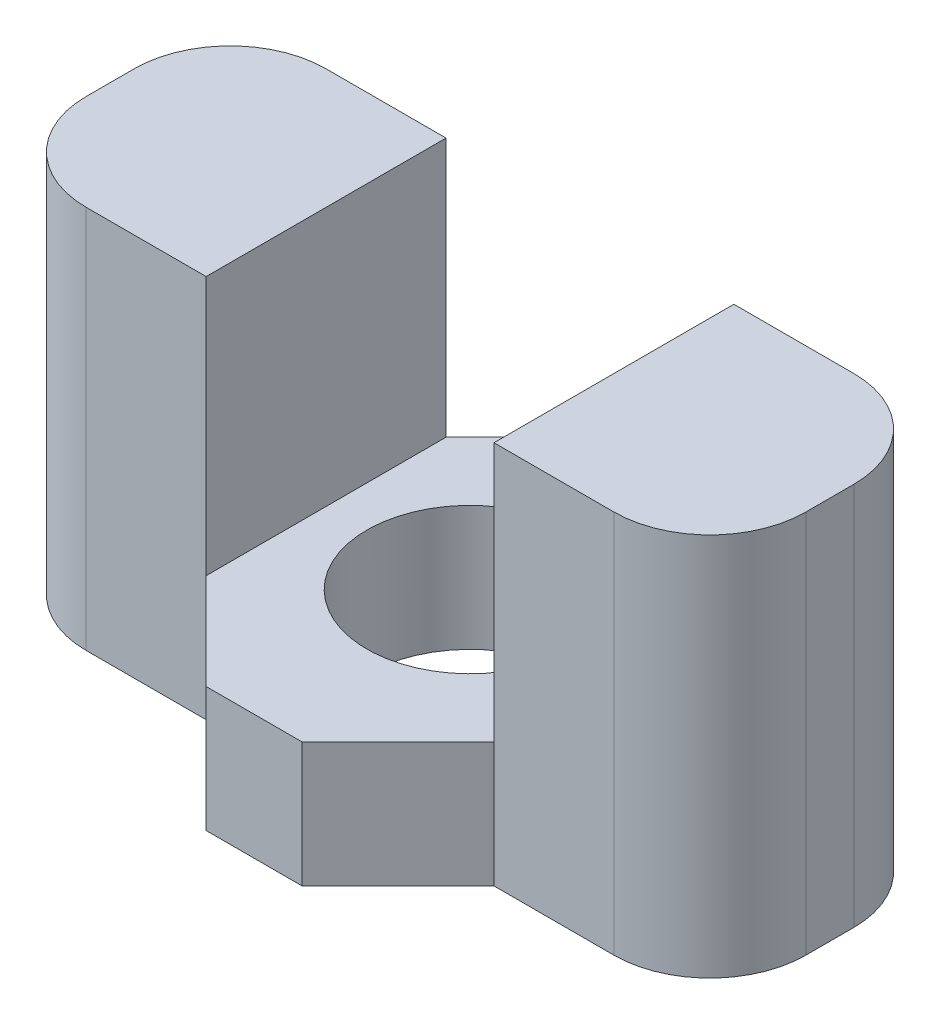
ISO-10303-21;
HEADER;
FILE_DESCRIPTION(('STEP AP214'),'2;1');
FILE_NAME('part.step','',(''),(''),'','','');
FILE_SCHEMA(('AUTOMOTIVE_DESIGN { 1 0 10303 214 1 1 1 1 }'));
ENDSEC;
DATA;
#1=APPLICATION_CONTEXT('core data for automotive mechanical design processes');
#2=APPLICATION_PROTOCOL_DEFINITION('international standard','automotive_design',2000,#1);
#3=PRODUCT_CONTEXT('',#1,'mechanical');
#4=PRODUCT('Part','Part','',(#3));
#5=PRODUCT_RELATED_PRODUCT_CATEGORY('part','',(#4));
#6=PRODUCT_DEFINITION_FORMATION('','',#4);
#7=PRODUCT_DEFINITION_CONTEXT('part definition',#1,'design');
#8=PRODUCT_DEFINITION('design','',#6,#7);
#9=PRODUCT_DEFINITION_SHAPE('','',#8);
#10=(LENGTH_UNIT() NAMED_UNIT(*) SI_UNIT(.MILLI.,.METRE.));
#11=(NAMED_UNIT(*) PLANE_ANGLE_UNIT() SI_UNIT($,.RADIAN.));
#12=(NAMED_UNIT(*) SI_UNIT($,.STERADIAN.) SOLID_ANGLE_UNIT());
#13=UNCERTAINTY_MEASURE_WITH_UNIT(LENGTH_MEASURE(1.E-05),#10,'distance_accuracy_value','');
#14=(GEOMETRIC_REPRESENTATION_CONTEXT(3) GLOBAL_UNCERTAINTY_ASSIGNED_CONTEXT((#13)) GLOBAL_UNIT_ASSIGNED_CONTEXT((#10,
#11,#12)) REPRESENTATION_CONTEXT('',''));
#15=CARTESIAN_POINT('',(0.,0.,0.));
#16=DIRECTION('',(0.,0.,1.));
#17=DIRECTION('',(1.,0.,0.));
#18=AXIS2_PLACEMENT_3D('',#15,#16,#17);
#19=CARTESIAN_POINT('',(0.,8.,2.5));
#20=DIRECTION('',(0.,0.,-1.));
#21=DIRECTION('',(-1.,0.,0.));
#22=AXIS2_PLACEMENT_3D('',#19,#20,#21);
#23=PLANE('',#22);
#24=DIRECTION('',(1.,0.,0.));
#25=VECTOR('',#24,1.);
#26=CARTESIAN_POINT('',(0.,8.,2.5));
#27=LINE('',#26,#25);
#28=CARTESIAN_POINT('',(-5.5,8.,2.5));
#29=VERTEX_POINT('',#28);
#30=CARTESIAN_POINT('',(-3.00000000000002,8.,2.5));
#31=VERTEX_POINT('',#30);
#32=EDGE_CURVE('E278',#29,#31,#27,.T.);
#33=ORIENTED_EDGE('',*,*,#32,.F.);
#34=DIRECTION('',(0.,-1.,0.));
#35=VECTOR('',#34,1.);
#36=CARTESIAN_POINT('',(-5.5,8.,2.5));
#37=LINE('',#36,#35);
#38=CARTESIAN_POINT('',(-5.5,0.,2.5));
#39=VERTEX_POINT('',#38);
#40=EDGE_CURVE('E11',#29,#39,#37,.T.);
#41=ORIENTED_EDGE('',*,*,#40,.T.);
#42=DIRECTION('',(1.,0.,0.));
#43=VECTOR('',#42,1.);
#44=CARTESIAN_POINT('',(0.,0.,2.5));
#45=LINE('',#44,#43);
#46=CARTESIAN_POINT('',(-3.,0.,2.5));
#47=VERTEX_POINT('',#46);
#48=EDGE_CURVE('E166',#39,#47,#45,.T.);
#49=ORIENTED_EDGE('',*,*,#48,.T.);
#50=DIRECTION('',(0.,-1.,0.));
#51=VECTOR('',#50,1.);
#52=CARTESIAN_POINT('',(-3.,8.92455532033676,2.5));
#53=LINE('',#52,#51);
#54=CARTESIAN_POINT('',(-3.,2.6,2.5));
#55=VERTEX_POINT('',#54);
#56=EDGE_CURVE('E170',#55,#47,#53,.T.);
#57=ORIENTED_EDGE('',*,*,#56,.F.);
#58=DIRECTION('',(0.,1.,0.));
#59=VECTOR('',#58,1.);
#60=CARTESIAN_POINT('',(-2.99999999999999,0.,2.5));
#61=LINE('',#60,#59);
#62=EDGE_CURVE('E215',#55,#31,#61,.T.);
#63=ORIENTED_EDGE('',*,*,#62,.T.);
#64=EDGE_LOOP('',(#33,#41,#49,#57,#63));
#65=FACE_BOUND('',#64,.T.);
#66=ADVANCED_FACE('F40',(#65),#23,.F.);
#67=CARTESIAN_POINT('',(0.,8.,-2.5));
#68=DIRECTION('',(0.,0.,-1.));
#69=DIRECTION('',(-1.,0.,0.));
#70=AXIS2_PLACEMENT_3D('',#67,#68,#69);
#71=PLANE('',#70);
#72=DIRECTION('',(1.,0.,0.));
#73=VECTOR('',#72,1.);
#74=CARTESIAN_POINT('',(0.,0.,-2.5));
#75=LINE('',#74,#73);
#76=CARTESIAN_POINT('',(-5.5,0.,-2.5));
#77=VERTEX_POINT('',#76);
#78=CARTESIAN_POINT('',(-3.,0.,-2.5));
#79=VERTEX_POINT('',#78);
#80=EDGE_CURVE('E287',#77,#79,#75,.T.);
#81=ORIENTED_EDGE('',*,*,#80,.F.);
#82=DIRECTION('',(0.,-1.,0.));
#83=VECTOR('',#82,1.);
#84=CARTESIAN_POINT('',(-5.5,8.,-2.5));
#85=LINE('',#84,#83);
#86=CARTESIAN_POINT('',(-5.5,8.,-2.5));
#87=VERTEX_POINT('',#86);
#88=EDGE_CURVE('E304',#77,#87,#85,.F.);
#89=ORIENTED_EDGE('',*,*,#88,.T.);
#90=DIRECTION('',(1.,0.,0.));
#91=VECTOR('',#90,1.);
#92=CARTESIAN_POINT('',(0.,8.,-2.5));
#93=LINE('',#92,#91);
#94=CARTESIAN_POINT('',(-3.00000000000002,8.,-2.5));
#95=VERTEX_POINT('',#94);
#96=EDGE_CURVE('E272',#87,#95,#93,.T.);
#97=ORIENTED_EDGE('',*,*,#96,.T.);
#98=DIRECTION('',(0.,1.,0.));
#99=VECTOR('',#98,1.);
#100=CARTESIAN_POINT('',(-2.99999999999999,0.,-2.5));
#101=LINE('',#100,#99);
#102=CARTESIAN_POINT('',(-3.,2.6,-2.5));
#103=VERTEX_POINT('',#102);
#104=EDGE_CURVE('E238',#103,#95,#101,.T.);
#105=ORIENTED_EDGE('',*,*,#104,.F.);
#106=DIRECTION('',(0.,-1.,0.));
#107=VECTOR('',#106,1.);
#108=CARTESIAN_POINT('',(-3.,8.92455532033676,-2.5));
#109=LINE('',#108,#107);
#110=EDGE_CURVE('E230',#103,#79,#109,.T.);
#111=ORIENTED_EDGE('',*,*,#110,.T.);
#112=EDGE_LOOP('',(#81,#89,#97,#105,#111));
#113=FACE_BOUND('',#112,.T.);
#114=ADVANCED_FACE('F379',(#113),#71,.T.);
#115=CARTESIAN_POINT('',(3.00000000000002,8.,-2.5));
#116=VERTEX_POINT('',#115);
#117=CARTESIAN_POINT('',(5.5,8.,-2.5));
#118=VERTEX_POINT('',#117);
#119=EDGE_CURVE('E271',#116,#118,#93,.T.);
#120=ORIENTED_EDGE('',*,*,#119,.T.);
#121=DIRECTION('',(0.,-1.,0.));
#122=VECTOR('',#121,1.);
#123=CARTESIAN_POINT('',(5.5,8.,-2.5));
#124=LINE('',#123,#122);
#125=CARTESIAN_POINT('',(5.5,0.,-2.5));
#126=VERTEX_POINT('',#125);
#127=EDGE_CURVE('E310',#118,#126,#124,.T.);
#128=ORIENTED_EDGE('',*,*,#127,.T.);
#129=CARTESIAN_POINT('',(3.,0.,-2.5));
#130=VERTEX_POINT('',#129);
#131=EDGE_CURVE('E286',#130,#126,#75,.T.);
#132=ORIENTED_EDGE('',*,*,#131,.F.);
#133=DIRECTION('',(0.,-1.,0.));
#134=VECTOR('',#133,1.);
#135=CARTESIAN_POINT('',(3.,8.92455532033676,-2.5));
#136=LINE('',#135,#134);
#137=CARTESIAN_POINT('',(3.,2.6,-2.5));
#138=VERTEX_POINT('',#137);
#139=EDGE_CURVE('E228',#138,#130,#136,.T.);
#140=ORIENTED_EDGE('',*,*,#139,.F.);
#141=DIRECTION('',(0.,1.,0.));
#142=VECTOR('',#141,1.);
#143=CARTESIAN_POINT('',(2.99999999999999,0.,-2.5));
#144=LINE('',#143,#142);
#145=EDGE_CURVE('E241',#138,#116,#144,.T.);
#146=ORIENTED_EDGE('',*,*,#145,.T.);
#147=EDGE_LOOP('',(#120,#128,#132,#140,#146));
#148=FACE_BOUND('',#147,.T.);
#149=ADVANCED_FACE('F328',(#148),#71,.T.);
#150=CARTESIAN_POINT('',(3.,0.,2.5));
#151=VERTEX_POINT('',#150);
#152=CARTESIAN_POINT('',(5.5,0.,2.5));
#153=VERTEX_POINT('',#152);
#154=EDGE_CURVE('E176',#151,#153,#45,.T.);
#155=ORIENTED_EDGE('',*,*,#154,.T.);
#156=DIRECTION('',(0.,-1.,0.));
#157=VECTOR('',#156,1.);
#158=CARTESIAN_POINT('',(5.5,8.,2.5));
#159=LINE('',#158,#157);
#160=CARTESIAN_POINT('',(5.5,8.,2.5));
#161=VERTEX_POINT('',#160);
#162=EDGE_CURVE('E48',#153,#161,#159,.F.);
#163=ORIENTED_EDGE('',*,*,#162,.T.);
#164=CARTESIAN_POINT('',(3.00000000000002,8.,2.5));
#165=VERTEX_POINT('',#164);
#166=EDGE_CURVE('E277',#165,#161,#27,.T.);
#167=ORIENTED_EDGE('',*,*,#166,.F.);
#168=DIRECTION('',(0.,1.,0.));
#169=VECTOR('',#168,1.);
#170=CARTESIAN_POINT('',(2.99999999999999,0.,2.5));
#171=LINE('',#170,#169);
#172=CARTESIAN_POINT('',(3.,2.6,2.5));
#173=VERTEX_POINT('',#172);
#174=EDGE_CURVE('E236',#173,#165,#171,.T.);
#175=ORIENTED_EDGE('',*,*,#174,.F.);
#176=DIRECTION('',(0.,-1.,0.));
#177=VECTOR('',#176,1.);
#178=CARTESIAN_POINT('',(3.,8.92455532033676,2.5));
#179=LINE('',#178,#177);
#180=EDGE_CURVE('E201',#173,#151,#179,.T.);
#181=ORIENTED_EDGE('',*,*,#180,.T.);
#182=EDGE_LOOP('',(#155,#163,#167,#175,#181));
#183=FACE_BOUND('',#182,.T.);
#184=ADVANCED_FACE('F343',(#183),#23,.F.);
#185=CARTESIAN_POINT('',(0.,8.,0.));
#186=DIRECTION('',(0.,1.,0.));
#187=DIRECTION('',(0.,0.,1.));
#188=AXIS2_PLACEMENT_3D('',#185,#186,#187);
#189=PLANE('',#188);
#190=ORIENTED_EDGE('',*,*,#96,.F.);
#191=CARTESIAN_POINT('',(-5.5,8.,-0.5));
#192=DIRECTION('',(0.,1.,0.));
#193=DIRECTION('',(0.,0.,1.));
#194=AXIS2_PLACEMENT_3D('',#191,#192,#193);
#195=CIRCLE('',#194,2.);
#196=CARTESIAN_POINT('',(-7.5,8.,-0.499999999999999));
#197=VERTEX_POINT('',#196);
#198=EDGE_CURVE('E308',#87,#197,#195,.T.);
#199=ORIENTED_EDGE('',*,*,#198,.T.);
#200=DIRECTION('',(0.,0.,1.));
#201=VECTOR('',#200,1.);
#202=CARTESIAN_POINT('',(-7.5,8.,0.));
#203=LINE('',#202,#201);
#204=CARTESIAN_POINT('',(-7.5,8.,0.500000000000001));
#205=VERTEX_POINT('',#204);
#206=EDGE_CURVE('E274',#197,#205,#203,.T.);
#207=ORIENTED_EDGE('',*,*,#206,.T.);
#208=CARTESIAN_POINT('',(-5.5,8.,0.5));
#209=DIRECTION('',(0.,1.,0.));
#210=DIRECTION('',(0.,0.,1.));
#211=AXIS2_PLACEMENT_3D('',#208,#209,#210);
#212=CIRCLE('',#211,2.);
#213=EDGE_CURVE('E306',#205,#29,#212,.T.);
#214=ORIENTED_EDGE('',*,*,#213,.T.);
#215=ORIENTED_EDGE('',*,*,#32,.T.);
#216=DIRECTION('',(0.,0.,1.));
#217=VECTOR('',#216,1.);
#218=CARTESIAN_POINT('',(-3.00000000000002,8.,-2.5));
#219=LINE('',#218,#217);
#220=EDGE_CURVE('E245',#95,#31,#219,.T.);
#221=ORIENTED_EDGE('',*,*,#220,.F.);
#222=EDGE_LOOP('',(#190,#199,#207,#214,#215,#221));
#223=FACE_BOUND('',#222,.T.);
#224=ADVANCED_FACE('F412',(#223),#189,.T.);
#225=CARTESIAN_POINT('',(7.5,8.,0.));
#226=DIRECTION('',(1.,0.,0.));
#227=DIRECTION('',(0.,0.,-1.));
#228=AXIS2_PLACEMENT_3D('',#225,#226,#227);
#229=PLANE('',#228);
#230=DIRECTION('',(0.,0.,1.));
#231=VECTOR('',#230,1.);
#232=CARTESIAN_POINT('',(7.5,0.,0.));
#233=LINE('',#232,#231);
#234=CARTESIAN_POINT('',(7.5,0.,-0.5));
#235=VERTEX_POINT('',#234);
#236=CARTESIAN_POINT('',(7.5,0.,0.5));
#237=VERTEX_POINT('',#236);
#238=EDGE_CURVE('E283',#235,#237,#233,.T.);
#239=ORIENTED_EDGE('',*,*,#238,.F.);
#240=DIRECTION('',(0.,-1.,0.));
#241=VECTOR('',#240,1.);
#242=CARTESIAN_POINT('',(7.5,8.,-0.5));
#243=LINE('',#242,#241);
#244=CARTESIAN_POINT('',(7.5,8.,-0.5));
#245=VERTEX_POINT('',#244);
#246=EDGE_CURVE('E316',#235,#245,#243,.F.);
#247=ORIENTED_EDGE('',*,*,#246,.T.);
#248=DIRECTION('',(0.,0.,1.));
#249=VECTOR('',#248,1.);
#250=CARTESIAN_POINT('',(7.5,8.,0.));
#251=LINE('',#250,#249);
#252=CARTESIAN_POINT('',(7.5,8.,0.5));
#253=VERTEX_POINT('',#252);
#254=EDGE_CURVE('E175',#245,#253,#251,.T.);
#255=ORIENTED_EDGE('',*,*,#254,.T.);
#256=DIRECTION('',(0.,-1.,0.));
#257=VECTOR('',#256,1.);
#258=CARTESIAN_POINT('',(7.5,0.,0.5));
#259=LINE('',#258,#257);
#260=EDGE_CURVE('E313',#253,#237,#259,.T.);
#261=ORIENTED_EDGE('',*,*,#260,.T.);
#262=EDGE_LOOP('',(#239,#247,#255,#261));
#263=FACE_BOUND('',#262,.T.);
#264=ADVANCED_FACE('F337',(#263),#229,.T.);
#265=CARTESIAN_POINT('',(-7.5,8.,0.));
#266=DIRECTION('',(1.,0.,0.));
#267=DIRECTION('',(0.,0.,-1.));
#268=AXIS2_PLACEMENT_3D('',#265,#266,#267);
#269=PLANE('',#268);
#270=ORIENTED_EDGE('',*,*,#206,.F.);
#271=DIRECTION('',(0.,-1.,0.));
#272=VECTOR('',#271,1.);
#273=CARTESIAN_POINT('',(-7.5,0.,-0.499999999999999));
#274=LINE('',#273,#272);
#275=CARTESIAN_POINT('',(-7.5,0.,-0.499999999999999));
#276=VERTEX_POINT('',#275);
#277=EDGE_CURVE('E293',#197,#276,#274,.T.);
#278=ORIENTED_EDGE('',*,*,#277,.T.);
#279=DIRECTION('',(0.,0.,1.));
#280=VECTOR('',#279,1.);
#281=CARTESIAN_POINT('',(-7.5,0.,0.));
#282=LINE('',#281,#280);
#283=CARTESIAN_POINT('',(-7.5,0.,0.500000000000001));
#284=VERTEX_POINT('',#283);
#285=EDGE_CURVE('E289',#276,#284,#282,.T.);
#286=ORIENTED_EDGE('',*,*,#285,.T.);
#287=DIRECTION('',(0.,-1.,0.));
#288=VECTOR('',#287,1.);
#289=CARTESIAN_POINT('',(-7.5,8.,0.500000000000001));
#290=LINE('',#289,#288);
#291=EDGE_CURVE('E280',#284,#205,#290,.F.);
#292=ORIENTED_EDGE('',*,*,#291,.T.);
#293=EDGE_LOOP('',(#270,#278,#286,#292));
#294=FACE_BOUND('',#293,.T.);
#295=ADVANCED_FACE('F370',(#294),#269,.F.);
#296=CARTESIAN_POINT('',(0.,8.,0.));
#297=DIRECTION('',(0.,-1.,0.));
#298=DIRECTION('',(0.,0.,-1.));
#299=AXIS2_PLACEMENT_3D('',#296,#297,#298);
#300=CYLINDRICAL_SURFACE('',#299,2.15);
#301=CARTESIAN_POINT('',(0.,2.6,0.));
#302=DIRECTION('',(0.,-1.,0.));
#303=DIRECTION('',(0.,0.,-1.));
#304=AXIS2_PLACEMENT_3D('',#301,#302,#303);
#305=CIRCLE('',#304,2.15);
#306=CARTESIAN_POINT('',(0.,2.6,-2.15));
#307=VERTEX_POINT('',#306);
#308=EDGE_CURVE('E248',#307,#307,#305,.T.);
#309=ORIENTED_EDGE('',*,*,#308,.F.);
#310=EDGE_LOOP('',(#309));
#311=FACE_BOUND('',#310,.T.);
#312=CARTESIAN_POINT('',(0.,0.,0.));
#313=DIRECTION('',(0.,1.,0.));
#314=DIRECTION('',(0.,0.,1.));
#315=AXIS2_PLACEMENT_3D('',#312,#313,#314);
#316=CIRCLE('',#315,2.15);
#317=CARTESIAN_POINT('',(0.,0.,2.15));
#318=VERTEX_POINT('',#317);
#319=EDGE_CURVE('E261',#318,#318,#316,.T.);
#320=ORIENTED_EDGE('',*,*,#319,.F.);
#321=EDGE_LOOP('',(#320));
#322=FACE_BOUND('',#321,.T.);
#323=ADVANCED_FACE('F423',(#311,#322),#300,.F.);
#324=ORIENTED_EDGE('',*,*,#254,.F.);
#325=CARTESIAN_POINT('',(5.5,8.,-0.5));
#326=DIRECTION('',(0.,1.,0.));
#327=DIRECTION('',(0.,0.,1.));
#328=AXIS2_PLACEMENT_3D('',#325,#326,#327);
#329=CIRCLE('',#328,2.);
#330=EDGE_CURVE('E319',#245,#118,#329,.T.);
#331=ORIENTED_EDGE('',*,*,#330,.T.);
#332=ORIENTED_EDGE('',*,*,#119,.F.);
#333=DIRECTION('',(0.,0.,1.));
#334=VECTOR('',#333,1.);
#335=CARTESIAN_POINT('',(3.00000000000002,8.,-2.5));
#336=LINE('',#335,#334);
#337=EDGE_CURVE('E249',#116,#165,#336,.T.);
#338=ORIENTED_EDGE('',*,*,#337,.T.);
#339=ORIENTED_EDGE('',*,*,#166,.T.);
#340=CARTESIAN_POINT('',(5.5,8.,0.5));
#341=DIRECTION('',(0.,1.,0.));
#342=DIRECTION('',(0.,0.,1.));
#343=AXIS2_PLACEMENT_3D('',#340,#341,#342);
#344=CIRCLE('',#343,2.);
#345=EDGE_CURVE('E61',#161,#253,#344,.T.);
#346=ORIENTED_EDGE('',*,*,#345,.T.);
#347=EDGE_LOOP('',(#324,#331,#332,#338,#339,#346));
#348=FACE_BOUND('',#347,.T.);
#349=ADVANCED_FACE('F323',(#348),#189,.T.);
#350=CARTESIAN_POINT('',(0.,0.,0.));
#351=DIRECTION('',(0.,1.,0.));
#352=DIRECTION('',(0.,0.,1.));
#353=AXIS2_PLACEMENT_3D('',#350,#351,#352);
#354=PLANE('',#353);
#355=CARTESIAN_POINT('',(-5.,0.,0.));
#356=DIRECTION('',(0.,1.,0.));
#357=DIRECTION('',(0.,0.,1.));
#358=AXIS2_PLACEMENT_3D('',#355,#356,#357);
#359=CIRCLE('',#358,2.075);
#360=CARTESIAN_POINT('',(-5.,0.,2.075));
#361=VERTEX_POINT('',#360);
#362=EDGE_CURVE('E262',#361,#361,#359,.T.);
#363=ORIENTED_EDGE('',*,*,#362,.T.);
#364=EDGE_LOOP('',(#363));
#365=FACE_BOUND('',#364,.T.);
#366=CARTESIAN_POINT('',(5.,0.,0.));
#367=DIRECTION('',(0.,1.,0.));
#368=DIRECTION('',(0.,0.,1.));
#369=AXIS2_PLACEMENT_3D('',#366,#367,#368);
#370=CIRCLE('',#369,2.075);
#371=CARTESIAN_POINT('',(5.,0.,2.075));
#372=VERTEX_POINT('',#371);
#373=EDGE_CURVE('E257',#372,#372,#370,.T.);
#374=ORIENTED_EDGE('',*,*,#373,.T.);
#375=EDGE_LOOP('',(#374));
#376=FACE_BOUND('',#375,.T.);
#377=ORIENTED_EDGE('',*,*,#319,.T.);
#378=EDGE_LOOP('',(#377));
#379=FACE_BOUND('',#378,.T.);
#380=ORIENTED_EDGE('',*,*,#285,.F.);
#381=CARTESIAN_POINT('',(-5.5,0.,-0.5));
#382=DIRECTION('',(0.,1.,0.));
#383=DIRECTION('',(0.,0.,1.));
#384=AXIS2_PLACEMENT_3D('',#381,#382,#383);
#385=CIRCLE('',#384,2.);
#386=EDGE_CURVE('E302',#276,#77,#385,.F.);
#387=ORIENTED_EDGE('',*,*,#386,.T.);
#388=ORIENTED_EDGE('',*,*,#80,.T.);
#389=DIRECTION('',(0.707106781186551,0.,-0.707106781186544));
#390=VECTOR('',#389,1.);
#391=CARTESIAN_POINT('',(-2.74999999999998,0.,-2.75000000000001));
#392=LINE('',#391,#390);
#393=CARTESIAN_POINT('',(-0.999999999999974,0.,-4.5));
#394=VERTEX_POINT('',#393);
#395=EDGE_CURVE('E209',#79,#394,#392,.T.);
#396=ORIENTED_EDGE('',*,*,#395,.T.);
#397=DIRECTION('',(-1.,0.,0.));
#398=VECTOR('',#397,1.);
#399=CARTESIAN_POINT('',(0.,0.,-4.5));
#400=LINE('',#399,#398);
#401=CARTESIAN_POINT('',(0.999999999999979,0.,-4.5));
#402=VERTEX_POINT('',#401);
#403=EDGE_CURVE('E221',#402,#394,#400,.T.);
#404=ORIENTED_EDGE('',*,*,#403,.F.);
#405=DIRECTION('',(-0.707106781186551,0.,-0.707106781186544));
#406=VECTOR('',#405,1.);
#407=CARTESIAN_POINT('',(2.74999999999998,0.,-2.75000000000001));
#408=LINE('',#407,#406);
#409=EDGE_CURVE('E218',#130,#402,#408,.T.);
#410=ORIENTED_EDGE('',*,*,#409,.F.);
#411=ORIENTED_EDGE('',*,*,#131,.T.);
#412=CARTESIAN_POINT('',(5.5,0.,-0.5));
#413=DIRECTION('',(0.,1.,0.));
#414=DIRECTION('',(0.,0.,1.));
#415=AXIS2_PLACEMENT_3D('',#412,#413,#414);
#416=CIRCLE('',#415,2.);
#417=EDGE_CURVE('E300',#126,#235,#416,.F.);
#418=ORIENTED_EDGE('',*,*,#417,.T.);
#419=ORIENTED_EDGE('',*,*,#238,.T.);
#420=CARTESIAN_POINT('',(5.5,0.,0.5));
#421=DIRECTION('',(0.,1.,0.));
#422=DIRECTION('',(0.,0.,1.));
#423=AXIS2_PLACEMENT_3D('',#420,#421,#422);
#424=CIRCLE('',#423,2.);
#425=EDGE_CURVE('E298',#237,#153,#424,.F.);
#426=ORIENTED_EDGE('',*,*,#425,.T.);
#427=ORIENTED_EDGE('',*,*,#154,.F.);
#428=DIRECTION('',(-0.707106781186551,0.,0.707106781186544));
#429=VECTOR('',#428,1.);
#430=CARTESIAN_POINT('',(2.74999999999998,0.,2.75000000000001));
#431=LINE('',#430,#429);
#432=CARTESIAN_POINT('',(0.999999999999978,0.,4.5));
#433=VERTEX_POINT('',#432);
#434=EDGE_CURVE('E195',#151,#433,#431,.T.);
#435=ORIENTED_EDGE('',*,*,#434,.T.);
#436=DIRECTION('',(-1.,0.,0.));
#437=VECTOR('',#436,1.);
#438=CARTESIAN_POINT('',(0.,0.,4.5));
#439=LINE('',#438,#437);
#440=CARTESIAN_POINT('',(-0.999999999999976,0.,4.5));
#441=VERTEX_POINT('',#440);
#442=EDGE_CURVE('E193',#433,#441,#439,.T.);
#443=ORIENTED_EDGE('',*,*,#442,.T.);
#444=DIRECTION('',(0.707106781186551,0.,0.707106781186544));
#445=VECTOR('',#444,1.);
#446=CARTESIAN_POINT('',(-2.74999999999998,0.,2.75000000000001));
#447=LINE('',#446,#445);
#448=EDGE_CURVE('E183',#47,#441,#447,.T.);
#449=ORIENTED_EDGE('',*,*,#448,.F.);
#450=ORIENTED_EDGE('',*,*,#48,.F.);
#451=CARTESIAN_POINT('',(-5.5,0.,0.5));
#452=DIRECTION('',(0.,1.,0.));
#453=DIRECTION('',(0.,0.,1.));
#454=AXIS2_PLACEMENT_3D('',#451,#452,#453);
#455=CIRCLE('',#454,2.);
#456=EDGE_CURVE('E296',#39,#284,#455,.F.);
#457=ORIENTED_EDGE('',*,*,#456,.T.);
#458=EDGE_LOOP('',(#380,#387,#388,#396,#404,#410,#411,#418,#419,#426,#427,#435,#443,#449,#450,#457));
#459=FACE_BOUND('',#458,.T.);
#460=ADVANCED_FACE('F190',(#365,#376,#379,#459),#354,.F.);
#461=CARTESIAN_POINT('',(5.,2.,0.));
#462=DIRECTION('',(0.,-1.,0.));
#463=DIRECTION('',(0.,0.,-1.));
#464=AXIS2_PLACEMENT_3D('',#461,#462,#463);
#465=CYLINDRICAL_SURFACE('',#464,2.075);
#466=CARTESIAN_POINT('',(5.,2.,0.));
#467=DIRECTION('',(0.,1.,0.));
#468=DIRECTION('',(0.,0.,1.));
#469=AXIS2_PLACEMENT_3D('',#466,#467,#468);
#470=CIRCLE('',#469,2.075);
#471=CARTESIAN_POINT('',(5.,2.,2.075));
#472=VERTEX_POINT('',#471);
#473=EDGE_CURVE('E265',#472,#472,#470,.T.);
#474=ORIENTED_EDGE('',*,*,#473,.T.);
#475=EDGE_LOOP('',(#474));
#476=FACE_BOUND('',#475,.T.);
#477=ORIENTED_EDGE('',*,*,#373,.F.);
#478=EDGE_LOOP('',(#477));
#479=FACE_BOUND('',#478,.T.);
#480=ADVANCED_FACE('F467',(#476,#479),#465,.F.);
#481=CARTESIAN_POINT('',(0.,2.,0.));
#482=DIRECTION('',(0.,1.,0.));
#483=DIRECTION('',(0.,0.,1.));
#484=AXIS2_PLACEMENT_3D('',#481,#482,#483);
#485=PLANE('',#484);
#486=ORIENTED_EDGE('',*,*,#473,.F.);
#487=EDGE_LOOP('',(#486));
#488=FACE_BOUND('',#487,.T.);
#489=ADVANCED_FACE('F619',(#488),#485,.F.);
#490=CARTESIAN_POINT('',(-5.,2.,0.));
#491=DIRECTION('',(0.,-1.,0.));
#492=DIRECTION('',(0.,0.,-1.));
#493=AXIS2_PLACEMENT_3D('',#490,#491,#492);
#494=CYLINDRICAL_SURFACE('',#493,2.075);
#495=CARTESIAN_POINT('',(-5.,2.,0.));
#496=DIRECTION('',(0.,1.,0.));
#497=DIRECTION('',(0.,0.,1.));
#498=AXIS2_PLACEMENT_3D('',#495,#496,#497);
#499=CIRCLE('',#498,2.075);
#500=CARTESIAN_POINT('',(-5.,2.,2.075));
#501=VERTEX_POINT('',#500);
#502=EDGE_CURVE('E258',#501,#501,#499,.T.);
#503=ORIENTED_EDGE('',*,*,#502,.T.);
#504=EDGE_LOOP('',(#503));
#505=FACE_BOUND('',#504,.T.);
#506=ORIENTED_EDGE('',*,*,#362,.F.);
#507=EDGE_LOOP('',(#506));
#508=FACE_BOUND('',#507,.T.);
#509=ADVANCED_FACE('F608',(#505,#508),#494,.F.);
#510=CARTESIAN_POINT('',(0.,2.,0.));
#511=DIRECTION('',(0.,1.,0.));
#512=DIRECTION('',(0.,0.,1.));
#513=AXIS2_PLACEMENT_3D('',#510,#511,#512);
#514=PLANE('',#513);
#515=ORIENTED_EDGE('',*,*,#502,.F.);
#516=EDGE_LOOP('',(#515));
#517=FACE_BOUND('',#516,.T.);
#518=ADVANCED_FACE('F400',(#517),#514,.F.);
#519=CARTESIAN_POINT('',(-2.99999999999999,0.,-2.5));
#520=DIRECTION('',(1.,0.,0.));
#521=DIRECTION('',(0.,1.,0.));
#522=AXIS2_PLACEMENT_3D('',#519,#520,#521);
#523=PLANE('',#522);
#524=DIRECTION('',(0.,0.,1.));
#525=VECTOR('',#524,1.);
#526=CARTESIAN_POINT('',(-3.,2.6,-2.5));
#527=LINE('',#526,#525);
#528=EDGE_CURVE('E244',#103,#55,#527,.T.);
#529=ORIENTED_EDGE('',*,*,#528,.F.);
#530=ORIENTED_EDGE('',*,*,#104,.T.);
#531=ORIENTED_EDGE('',*,*,#220,.T.);
#532=ORIENTED_EDGE('',*,*,#62,.F.);
#533=EDGE_LOOP('',(#529,#530,#531,#532));
#534=FACE_BOUND('',#533,.T.);
#535=ADVANCED_FACE('F362',(#534),#523,.T.);
#536=CARTESIAN_POINT('',(2.99999999999999,0.,-2.5));
#537=DIRECTION('',(1.,0.,0.));
#538=DIRECTION('',(0.,1.,0.));
#539=AXIS2_PLACEMENT_3D('',#536,#537,#538);
#540=PLANE('',#539);
#541=ORIENTED_EDGE('',*,*,#337,.F.);
#542=ORIENTED_EDGE('',*,*,#145,.F.);
#543=DIRECTION('',(0.,0.,1.));
#544=VECTOR('',#543,1.);
#545=CARTESIAN_POINT('',(3.,2.6,-2.5));
#546=LINE('',#545,#544);
#547=EDGE_CURVE('E252',#138,#173,#546,.T.);
#548=ORIENTED_EDGE('',*,*,#547,.T.);
#549=ORIENTED_EDGE('',*,*,#174,.T.);
#550=EDGE_LOOP('',(#541,#542,#548,#549));
#551=FACE_BOUND('',#550,.T.);
#552=ADVANCED_FACE('F391',(#551),#540,.F.);
#553=CARTESIAN_POINT('',(0.,2.6,-2.5));
#554=DIRECTION('',(0.,-1.,0.));
#555=DIRECTION('',(0.,0.,-1.));
#556=AXIS2_PLACEMENT_3D('',#553,#554,#555);
#557=PLANE('',#556);
#558=ORIENTED_EDGE('',*,*,#308,.T.);
#559=EDGE_LOOP('',(#558));
#560=FACE_BOUND('',#559,.T.);
#561=ORIENTED_EDGE('',*,*,#547,.F.);
#562=DIRECTION('',(0.707106781186551,0.,0.707106781186544));
#563=VECTOR('',#562,1.);
#564=CARTESIAN_POINT('',(2.74999999999998,2.6,-2.75000000000001));
#565=LINE('',#564,#563);
#566=CARTESIAN_POINT('',(0.999999999999979,2.6,-4.5));
#567=VERTEX_POINT('',#566);
#568=EDGE_CURVE('E210',#567,#138,#565,.T.);
#569=ORIENTED_EDGE('',*,*,#568,.F.);
#570=DIRECTION('',(1.,0.,0.));
#571=VECTOR('',#570,1.);
#572=CARTESIAN_POINT('',(0.,2.6,-4.5));
#573=LINE('',#572,#571);
#574=CARTESIAN_POINT('',(-0.999999999999974,2.6,-4.5));
#575=VERTEX_POINT('',#574);
#576=EDGE_CURVE('E213',#575,#567,#573,.T.);
#577=ORIENTED_EDGE('',*,*,#576,.F.);
#578=DIRECTION('',(-0.707106781186551,0.,0.707106781186544));
#579=VECTOR('',#578,1.);
#580=CARTESIAN_POINT('',(-2.74999999999998,2.6,-2.75000000000001));
#581=LINE('',#580,#579);
#582=EDGE_CURVE('E212',#575,#103,#581,.T.);
#583=ORIENTED_EDGE('',*,*,#582,.T.);
#584=ORIENTED_EDGE('',*,*,#528,.T.);
#585=DIRECTION('',(-0.707106781186551,0.,-0.707106781186544));
#586=VECTOR('',#585,1.);
#587=CARTESIAN_POINT('',(-2.74999999999998,2.6,2.75000000000001));
#588=LINE('',#587,#586);
#589=CARTESIAN_POINT('',(-0.999999999999976,2.6,4.5));
#590=VERTEX_POINT('',#589);
#591=EDGE_CURVE('E185',#590,#55,#588,.T.);
#592=ORIENTED_EDGE('',*,*,#591,.F.);
#593=DIRECTION('',(1.,0.,0.));
#594=VECTOR('',#593,1.);
#595=CARTESIAN_POINT('',(0.,2.6,4.5));
#596=LINE('',#595,#594);
#597=CARTESIAN_POINT('',(0.999999999999978,2.6,4.5));
#598=VERTEX_POINT('',#597);
#599=EDGE_CURVE('E186',#590,#598,#596,.T.);
#600=ORIENTED_EDGE('',*,*,#599,.T.);
#601=DIRECTION('',(0.707106781186551,0.,-0.707106781186544));
#602=VECTOR('',#601,1.);
#603=CARTESIAN_POINT('',(2.74999999999998,2.6,2.75000000000001));
#604=LINE('',#603,#602);
#605=EDGE_CURVE('E206',#598,#173,#604,.T.);
#606=ORIENTED_EDGE('',*,*,#605,.T.);
#607=EDGE_LOOP('',(#561,#569,#577,#583,#584,#592,#600,#606));
#608=FACE_BOUND('',#607,.T.);
#609=ADVANCED_FACE('F355',(#560,#608),#557,.F.);
#610=CARTESIAN_POINT('',(0.,8.92455532033676,-4.5));
#611=DIRECTION('',(0.,0.,1.));
#612=DIRECTION('',(1.,0.,0.));
#613=AXIS2_PLACEMENT_3D('',#610,#611,#612);
#614=PLANE('',#613);
#615=DIRECTION('',(0.,-1.,0.));
#616=VECTOR('',#615,1.);
#617=CARTESIAN_POINT('',(-0.999999999999974,8.92455532033676,-4.5));
#618=LINE('',#617,#616);
#619=EDGE_CURVE('E224',#575,#394,#618,.T.);
#620=ORIENTED_EDGE('',*,*,#619,.F.);
#621=ORIENTED_EDGE('',*,*,#576,.T.);
#622=DIRECTION('',(0.,-1.,0.));
#623=VECTOR('',#622,1.);
#624=CARTESIAN_POINT('',(0.999999999999979,8.92455532033676,-4.5));
#625=LINE('',#624,#623);
#626=EDGE_CURVE('E226',#567,#402,#625,.T.);
#627=ORIENTED_EDGE('',*,*,#626,.T.);
#628=ORIENTED_EDGE('',*,*,#403,.T.);
#629=EDGE_LOOP('',(#620,#621,#627,#628));
#630=FACE_BOUND('',#629,.T.);
#631=ADVANCED_FACE('F386',(#630),#614,.F.);
#632=CARTESIAN_POINT('',(2.74999999999998,8.92455532033676,-2.75000000000001));
#633=DIRECTION('',(-0.707106781186544,0.,0.707106781186551));
#634=DIRECTION('',(0.707106781186551,0.,0.707106781186544));
#635=AXIS2_PLACEMENT_3D('',#632,#633,#634);
#636=PLANE('',#635);
#637=ORIENTED_EDGE('',*,*,#626,.F.);
#638=ORIENTED_EDGE('',*,*,#568,.T.);
#639=ORIENTED_EDGE('',*,*,#139,.T.);
#640=ORIENTED_EDGE('',*,*,#409,.T.);
#641=EDGE_LOOP('',(#637,#638,#639,#640));
#642=FACE_BOUND('',#641,.T.);
#643=ADVANCED_FACE('F389',(#642),#636,.F.);
#644=CARTESIAN_POINT('',(-2.74999999999998,8.92455532033676,-2.75000000000001));
#645=DIRECTION('',(-0.707106781186544,0.,-0.707106781186551));
#646=DIRECTION('',(-0.707106781186551,0.,0.707106781186544));
#647=AXIS2_PLACEMENT_3D('',#644,#645,#646);
#648=PLANE('',#647);
#649=ORIENTED_EDGE('',*,*,#582,.F.);
#650=ORIENTED_EDGE('',*,*,#619,.T.);
#651=ORIENTED_EDGE('',*,*,#395,.F.);
#652=ORIENTED_EDGE('',*,*,#110,.F.);
#653=EDGE_LOOP('',(#649,#650,#651,#652));
#654=FACE_BOUND('',#653,.T.);
#655=ADVANCED_FACE('F382',(#654),#648,.T.);
#656=CARTESIAN_POINT('',(-2.74999999999998,8.92455532033676,2.75000000000001));
#657=DIRECTION('',(0.707106781186544,0.,-0.707106781186551));
#658=DIRECTION('',(-0.707106781186551,0.,-0.707106781186544));
#659=AXIS2_PLACEMENT_3D('',#656,#657,#658);
#660=PLANE('',#659);
#661=DIRECTION('',(0.,-1.,0.));
#662=VECTOR('',#661,1.);
#663=CARTESIAN_POINT('',(-0.999999999999976,8.92455532033676,4.5));
#664=LINE('',#663,#662);
#665=EDGE_CURVE('E187',#590,#441,#664,.T.);
#666=ORIENTED_EDGE('',*,*,#665,.F.);
#667=ORIENTED_EDGE('',*,*,#591,.T.);
#668=ORIENTED_EDGE('',*,*,#56,.T.);
#669=ORIENTED_EDGE('',*,*,#448,.T.);
#670=EDGE_LOOP('',(#666,#667,#668,#669));
#671=FACE_BOUND('',#670,.T.);
#672=ADVANCED_FACE('F182',(#671),#660,.F.);
#673=CARTESIAN_POINT('',(0.,8.92455532033676,4.5));
#674=DIRECTION('',(0.,0.,1.));
#675=DIRECTION('',(1.,0.,0.));
#676=AXIS2_PLACEMENT_3D('',#673,#674,#675);
#677=PLANE('',#676);
#678=ORIENTED_EDGE('',*,*,#599,.F.);
#679=ORIENTED_EDGE('',*,*,#665,.T.);
#680=ORIENTED_EDGE('',*,*,#442,.F.);
#681=DIRECTION('',(0.,-1.,0.));
#682=VECTOR('',#681,1.);
#683=CARTESIAN_POINT('',(0.999999999999978,8.92455532033676,4.5));
#684=LINE('',#683,#682);
#685=EDGE_CURVE('E203',#598,#433,#684,.T.);
#686=ORIENTED_EDGE('',*,*,#685,.F.);
#687=EDGE_LOOP('',(#678,#679,#680,#686));
#688=FACE_BOUND('',#687,.T.);
#689=ADVANCED_FACE('F352',(#688),#677,.T.);
#690=CARTESIAN_POINT('',(2.74999999999998,8.92455532033676,2.75000000000001));
#691=DIRECTION('',(0.707106781186544,0.,0.707106781186551));
#692=DIRECTION('',(0.707106781186551,0.,-0.707106781186544));
#693=AXIS2_PLACEMENT_3D('',#690,#691,#692);
#694=PLANE('',#693);
#695=ORIENTED_EDGE('',*,*,#605,.F.);
#696=ORIENTED_EDGE('',*,*,#685,.T.);
#697=ORIENTED_EDGE('',*,*,#434,.F.);
#698=ORIENTED_EDGE('',*,*,#180,.F.);
#699=EDGE_LOOP('',(#695,#696,#697,#698));
#700=FACE_BOUND('',#699,.T.);
#701=ADVANCED_FACE('F348',(#700),#694,.T.);
#702=CARTESIAN_POINT('',(-5.5,8.,-0.5));
#703=DIRECTION('',(0.,1.,0.));
#704=DIRECTION('',(0.,0.,1.));
#705=AXIS2_PLACEMENT_3D('',#702,#703,#704);
#706=CYLINDRICAL_SURFACE('',#705,2.);
#707=ORIENTED_EDGE('',*,*,#198,.F.);
#708=ORIENTED_EDGE('',*,*,#88,.F.);
#709=ORIENTED_EDGE('',*,*,#386,.F.);
#710=ORIENTED_EDGE('',*,*,#277,.F.);
#711=EDGE_LOOP('',(#707,#708,#709,#710));
#712=FACE_BOUND('',#711,.T.);
#713=ADVANCED_FACE('F374',(#712),#706,.T.);
#714=CARTESIAN_POINT('',(5.5,8.,-0.5));
#715=DIRECTION('',(0.,-1.,0.));
#716=DIRECTION('',(0.,0.,-1.));
#717=AXIS2_PLACEMENT_3D('',#714,#715,#716);
#718=CYLINDRICAL_SURFACE('',#717,2.);
#719=ORIENTED_EDGE('',*,*,#330,.F.);
#720=ORIENTED_EDGE('',*,*,#246,.F.);
#721=ORIENTED_EDGE('',*,*,#417,.F.);
#722=ORIENTED_EDGE('',*,*,#127,.F.);
#723=EDGE_LOOP('',(#719,#720,#721,#722));
#724=FACE_BOUND('',#723,.T.);
#725=ADVANCED_FACE('F333',(#724),#718,.T.);
#726=CARTESIAN_POINT('',(5.5,8.,0.5));
#727=DIRECTION('',(0.,1.,0.));
#728=DIRECTION('',(0.,0.,1.));
#729=AXIS2_PLACEMENT_3D('',#726,#727,#728);
#730=CYLINDRICAL_SURFACE('',#729,2.);
#731=ORIENTED_EDGE('',*,*,#345,.F.);
#732=ORIENTED_EDGE('',*,*,#162,.F.);
#733=ORIENTED_EDGE('',*,*,#425,.F.);
#734=ORIENTED_EDGE('',*,*,#260,.F.);
#735=EDGE_LOOP('',(#731,#732,#733,#734));
#736=FACE_BOUND('',#735,.T.);
#737=ADVANCED_FACE('F340',(#736),#730,.T.);
#738=CARTESIAN_POINT('',(-5.5,8.,0.5));
#739=DIRECTION('',(0.,-1.,0.));
#740=DIRECTION('',(0.,0.,-1.));
#741=AXIS2_PLACEMENT_3D('',#738,#739,#740);
#742=CYLINDRICAL_SURFACE('',#741,2.);
#743=ORIENTED_EDGE('',*,*,#213,.F.);
#744=ORIENTED_EDGE('',*,*,#291,.F.);
#745=ORIENTED_EDGE('',*,*,#456,.F.);
#746=ORIENTED_EDGE('',*,*,#40,.F.);
#747=EDGE_LOOP('',(#743,#744,#745,#746));
#748=FACE_BOUND('',#747,.T.);
#749=ADVANCED_FACE('F42',(#748),#742,.T.);
#750=CLOSED_SHELL('',(#66,#114,#149,#184,#224,#264,#295,#323,#349,#460,#480,#489,#509,#518,#535,
#552,#609,#631,#643,#655,#672,#689,#701,#713,#725,#737,#749));
#751=MANIFOLD_SOLID_BREP('B2',#750);
#752=ADVANCED_BREP_SHAPE_REPRESENTATION('',(#18,#751),#14);
#753=SHAPE_DEFINITION_REPRESENTATION(#9,#752);
ENDSEC;
END-ISO-10303-21;
